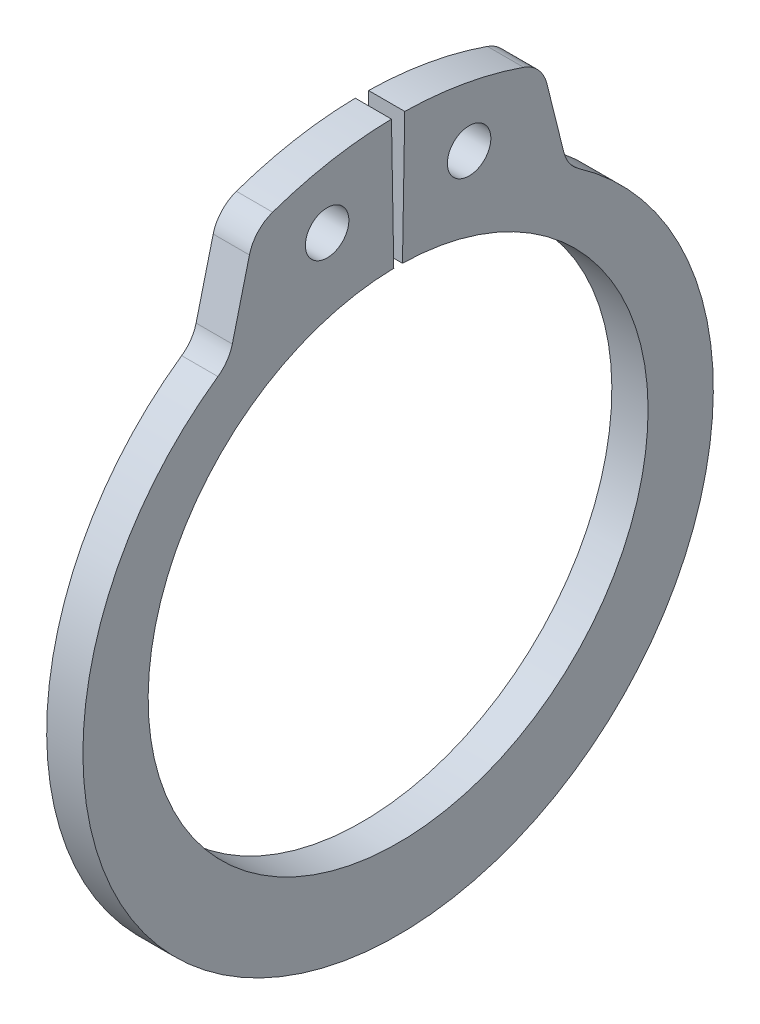
ISO-10303-21;
HEADER;
FILE_DESCRIPTION(('STEP AP214'),'2;1');
FILE_NAME('part.step','',(''),(''),'','','');
FILE_SCHEMA(('AUTOMOTIVE_DESIGN { 1 0 10303 214 1 1 1 1 }'));
ENDSEC;
DATA;
#1=APPLICATION_CONTEXT('core data for automotive mechanical design processes');
#2=APPLICATION_PROTOCOL_DEFINITION('international standard','automotive_design',2000,#1);
#3=PRODUCT_CONTEXT('',#1,'mechanical');
#4=PRODUCT('Part','Part','',(#3));
#5=PRODUCT_RELATED_PRODUCT_CATEGORY('part','',(#4));
#6=PRODUCT_DEFINITION_FORMATION('','',#4);
#7=PRODUCT_DEFINITION_CONTEXT('part definition',#1,'design');
#8=PRODUCT_DEFINITION('design','',#6,#7);
#9=PRODUCT_DEFINITION_SHAPE('','',#8);
#10=(LENGTH_UNIT() NAMED_UNIT(*) SI_UNIT(.MILLI.,.METRE.));
#11=(NAMED_UNIT(*) PLANE_ANGLE_UNIT() SI_UNIT($,.RADIAN.));
#12=(NAMED_UNIT(*) SI_UNIT($,.STERADIAN.) SOLID_ANGLE_UNIT());
#13=UNCERTAINTY_MEASURE_WITH_UNIT(LENGTH_MEASURE(1.E-05),#10,'distance_accuracy_value','');
#14=(GEOMETRIC_REPRESENTATION_CONTEXT(3) GLOBAL_UNCERTAINTY_ASSIGNED_CONTEXT((#13)) GLOBAL_UNIT_ASSIGNED_CONTEXT((#10,
#11,#12)) REPRESENTATION_CONTEXT('',''));
#15=CARTESIAN_POINT('',(0.,0.,0.));
#16=DIRECTION('',(0.,0.,1.));
#17=DIRECTION('',(1.,0.,0.));
#18=AXIS2_PLACEMENT_3D('',#15,#16,#17);
#19=CARTESIAN_POINT('',(0.5,0.,0.));
#20=DIRECTION('',(1.,0.,0.));
#21=DIRECTION('',(0.,0.,-1.));
#22=AXIS2_PLACEMENT_3D('',#19,#20,#21);
#23=PLANE('',#22);
#24=CARTESIAN_POINT('',(0.5,8.66711980549086,-1.9596288316201));
#25=DIRECTION('',(-1.,0.,0.));
#26=DIRECTION('',(0.,0.,1.));
#27=AXIS2_PLACEMENT_3D('',#24,#25,#26);
#28=CIRCLE('',#27,0.6);
#29=CARTESIAN_POINT('',(0.5,8.66711980549086,-1.3596288316201));
#30=VERTEX_POINT('',#29);
#31=EDGE_CURVE('E115',#30,#30,#28,.T.);
#32=ORIENTED_EDGE('',*,*,#31,.T.);
#33=EDGE_LOOP('',(#32));
#34=FACE_BOUND('',#33,.T.);
#35=CARTESIAN_POINT('',(0.5,0.,0.));
#36=DIRECTION('',(-1.,0.,0.));
#37=DIRECTION('',(0.,0.,1.));
#38=AXIS2_PLACEMENT_3D('',#35,#36,#37);
#39=CIRCLE('',#38,6.9);
#40=CARTESIAN_POINT('',(0.5,6.8989490965791,-0.120421604417256));
#41=VERTEX_POINT('',#40);
#42=CARTESIAN_POINT('',(0.5,6.8989490965791,0.120421604417256));
#43=VERTEX_POINT('',#42);
#44=EDGE_CURVE('E173',#41,#43,#39,.T.);
#45=ORIENTED_EDGE('',*,*,#44,.T.);
#46=DIRECTION('',(0.,-0.999847695156391,-0.0174524064372835));
#47=VECTOR('',#46,1.);
#48=CARTESIAN_POINT('',(0.5,6.8989490965791,0.120421604417256));
#49=LINE('',#48,#47);
#50=CARTESIAN_POINT('',(0.5,10.4984007991421,0.183250267591477));
#51=VERTEX_POINT('',#50);
#52=EDGE_CURVE('E126',#43,#51,#49,.F.);
#53=ORIENTED_EDGE('',*,*,#52,.T.);
#54=CARTESIAN_POINT('',(0.5,0.,0.));
#55=DIRECTION('',(-1.,0.,0.));
#56=DIRECTION('',(0.,0.,1.));
#57=AXIS2_PLACEMENT_3D('',#54,#55,#56);
#58=CIRCLE('',#57,10.5);
#59=CARTESIAN_POINT('',(0.5,9.91217887924345,3.46391539531209));
#60=VERTEX_POINT('',#59);
#61=EDGE_CURVE('E129',#60,#51,#58,.T.);
#62=ORIENTED_EDGE('',*,*,#61,.F.);
#63=CARTESIAN_POINT('',(0.5,8.96816184312502,3.13401869099666));
#64=DIRECTION('',(-1.,0.,0.));
#65=DIRECTION('',(0.,0.,1.));
#66=AXIS2_PLACEMENT_3D('',#63,#64,#65);
#67=CIRCLE('',#66,1.);
#68=CARTESIAN_POINT('',(0.5,9.21008373872469,4.10431441727265));
#69=VERTEX_POINT('',#68);
#70=EDGE_CURVE('E119',#69,#60,#67,.T.);
#71=ORIENTED_EDGE('',*,*,#70,.F.);
#72=DIRECTION('',(0.,0.970295726275997,-0.241921895599665));
#73=VECTOR('',#72,1.);
#74=CARTESIAN_POINT('',(0.5,9.71734472745919,3.97784004803122));
#75=LINE('',#74,#73);
#76=CARTESIAN_POINT('',(0.5,7.31761530924591,4.57615979123836));
#77=VERTEX_POINT('',#76);
#78=EDGE_CURVE('E114',#69,#77,#75,.F.);
#79=ORIENTED_EDGE('',*,*,#78,.T.);
#80=CARTESIAN_POINT('',(0.5,7.55953720484558,5.54645551751436));
#81=DIRECTION('',(-1.,0.,0.));
#82=DIRECTION('',(0.,0.,1.));
#83=AXIS2_PLACEMENT_3D('',#80,#81,#82);
#84=CIRCLE('',#83,1.);
#85=CARTESIAN_POINT('',(0.5,6.73911195964233,4.97470170945253));
#86=VERTEX_POINT('',#85);
#87=EDGE_CURVE('E105',#77,#86,#84,.T.);
#88=ORIENTED_EDGE('',*,*,#87,.T.);
#89=CARTESIAN_POINT('',(0.5,-0.399224177769538,0.));
#90=DIRECTION('',(-1.,0.,0.));
#91=DIRECTION('',(0.,0.,1.));
#92=AXIS2_PLACEMENT_3D('',#89,#90,#91);
#93=CIRCLE('',#92,8.70077582223046);
#94=CARTESIAN_POINT('',(0.5,6.73911195964233,-4.97470170945253));
#95=VERTEX_POINT('',#94);
#96=EDGE_CURVE('E183',#95,#86,#93,.T.);
#97=ORIENTED_EDGE('',*,*,#96,.F.);
#98=CARTESIAN_POINT('',(0.5,7.55953720484558,-5.54645551751436));
#99=DIRECTION('',(-1.,0.,0.));
#100=DIRECTION('',(0.,0.,1.));
#101=AXIS2_PLACEMENT_3D('',#98,#99,#100);
#102=CIRCLE('',#101,1.);
#103=CARTESIAN_POINT('',(0.5,7.31761530924591,-4.57615979123836));
#104=VERTEX_POINT('',#103);
#105=EDGE_CURVE('E180',#95,#104,#102,.T.);
#106=ORIENTED_EDGE('',*,*,#105,.T.);
#107=DIRECTION('',(0.,-0.970295726275997,-0.241921895599666));
#108=VECTOR('',#107,1.);
#109=CARTESIAN_POINT('',(0.5,9.71734472745919,-3.97784004803122));
#110=LINE('',#109,#108);
#111=CARTESIAN_POINT('',(0.5,9.21008373872469,-4.10431441727265));
#112=VERTEX_POINT('',#111);
#113=EDGE_CURVE('E136',#104,#112,#110,.F.);
#114=ORIENTED_EDGE('',*,*,#113,.T.);
#115=CARTESIAN_POINT('',(0.5,8.96816184312502,-3.13401869099666));
#116=DIRECTION('',(-1.,0.,0.));
#117=DIRECTION('',(0.,0.,1.));
#118=AXIS2_PLACEMENT_3D('',#115,#116,#117);
#119=CIRCLE('',#118,1.);
#120=CARTESIAN_POINT('',(0.5,9.91217887924345,-3.46391539531209));
#121=VERTEX_POINT('',#120);
#122=EDGE_CURVE('E138',#121,#112,#119,.T.);
#123=ORIENTED_EDGE('',*,*,#122,.F.);
#124=CARTESIAN_POINT('',(0.5,0.,0.));
#125=DIRECTION('',(-1.,0.,0.));
#126=DIRECTION('',(0.,0.,1.));
#127=AXIS2_PLACEMENT_3D('',#124,#125,#126);
#128=CIRCLE('',#127,10.5);
#129=CARTESIAN_POINT('',(0.5,10.4984007991421,-0.183250267591479));
#130=VERTEX_POINT('',#129);
#131=EDGE_CURVE('E175',#130,#121,#128,.T.);
#132=ORIENTED_EDGE('',*,*,#131,.F.);
#133=DIRECTION('',(0.,0.999847695156391,-0.0174524064372841));
#134=VECTOR('',#133,1.);
#135=CARTESIAN_POINT('',(0.5,10.4984007991421,-0.183250267591479));
#136=LINE('',#135,#134);
#137=EDGE_CURVE('E131',#130,#41,#136,.F.);
#138=ORIENTED_EDGE('',*,*,#137,.T.);
#139=EDGE_LOOP('',(#45,#53,#62,#71,#79,#88,#97,#106,#114,#123,#132,#138));
#140=FACE_BOUND('',#139,.T.);
#141=CARTESIAN_POINT('',(0.5,8.66711980549086,1.9596288316201));
#142=DIRECTION('',(-1.,0.,0.));
#143=DIRECTION('',(0.,0.,1.));
#144=AXIS2_PLACEMENT_3D('',#141,#142,#143);
#145=CIRCLE('',#144,0.6);
#146=CARTESIAN_POINT('',(0.5,8.66711980549086,2.5596288316201));
#147=VERTEX_POINT('',#146);
#148=EDGE_CURVE('E20',#147,#147,#145,.T.);
#149=ORIENTED_EDGE('',*,*,#148,.T.);
#150=EDGE_LOOP('',(#149));
#151=FACE_BOUND('',#150,.T.);
#152=ADVANCED_FACE('F17',(#34,#140,#151),#23,.T.);
#153=CARTESIAN_POINT('',(0.5,8.66711980549086,1.9596288316201));
#154=DIRECTION('',(-1.,0.,0.));
#155=DIRECTION('',(0.,0.,1.));
#156=AXIS2_PLACEMENT_3D('',#153,#154,#155);
#157=CYLINDRICAL_SURFACE('',#156,0.6);
#158=CARTESIAN_POINT('',(-0.5,8.66711980549086,1.9596288316201));
#159=DIRECTION('',(-1.,0.,0.));
#160=DIRECTION('',(0.,0.,1.));
#161=AXIS2_PLACEMENT_3D('',#158,#159,#160);
#162=CIRCLE('',#161,0.6);
#163=CARTESIAN_POINT('',(-0.5,8.66711980549086,2.5596288316201));
#164=VERTEX_POINT('',#163);
#165=EDGE_CURVE('E165',#164,#164,#162,.T.);
#166=ORIENTED_EDGE('',*,*,#165,.T.);
#167=EDGE_LOOP('',(#166));
#168=FACE_BOUND('',#167,.T.);
#169=ORIENTED_EDGE('',*,*,#148,.F.);
#170=EDGE_LOOP('',(#169));
#171=FACE_BOUND('',#170,.T.);
#172=ADVANCED_FACE('F368',(#168,#171),#157,.F.);
#173=CARTESIAN_POINT('',(0.5,7.55953720484558,5.54645551751436));
#174=DIRECTION('',(-1.,0.,0.));
#175=DIRECTION('',(0.,0.,1.));
#176=AXIS2_PLACEMENT_3D('',#173,#174,#175);
#177=CYLINDRICAL_SURFACE('',#176,1.);
#178=DIRECTION('',(1.,0.,0.));
#179=VECTOR('',#178,1.);
#180=CARTESIAN_POINT('',(0.5,7.31761530924591,4.57615979123836));
#181=LINE('',#180,#179);
#182=CARTESIAN_POINT('',(-0.5,7.31761530924591,4.57615979123836));
#183=VERTEX_POINT('',#182);
#184=EDGE_CURVE('E109',#77,#183,#181,.F.);
#185=ORIENTED_EDGE('',*,*,#184,.T.);
#186=CARTESIAN_POINT('',(-0.5,7.55953720484558,5.54645551751436));
#187=DIRECTION('',(-1.,0.,0.));
#188=DIRECTION('',(0.,0.,1.));
#189=AXIS2_PLACEMENT_3D('',#186,#187,#188);
#190=CIRCLE('',#189,1.);
#191=CARTESIAN_POINT('',(-0.5,6.73911195964233,4.97470170945253));
#192=VERTEX_POINT('',#191);
#193=EDGE_CURVE('E163',#183,#192,#190,.T.);
#194=ORIENTED_EDGE('',*,*,#193,.T.);
#195=DIRECTION('',(-1.,0.,0.));
#196=VECTOR('',#195,1.);
#197=CARTESIAN_POINT('',(0.5,6.73911195964233,4.97470170945253));
#198=LINE('',#197,#196);
#199=EDGE_CURVE('E110',#86,#192,#198,.T.);
#200=ORIENTED_EDGE('',*,*,#199,.F.);
#201=ORIENTED_EDGE('',*,*,#87,.F.);
#202=EDGE_LOOP('',(#185,#194,#200,#201));
#203=FACE_BOUND('',#202,.T.);
#204=ADVANCED_FACE('F107',(#203),#177,.F.);
#205=CARTESIAN_POINT('',(0.5,-0.399224177769538,0.));
#206=DIRECTION('',(-1.,0.,0.));
#207=DIRECTION('',(0.,0.,1.));
#208=AXIS2_PLACEMENT_3D('',#205,#206,#207);
#209=CYLINDRICAL_SURFACE('',#208,8.70077582223046);
#210=CARTESIAN_POINT('',(-0.5,-0.399224177769538,0.));
#211=DIRECTION('',(-1.,0.,0.));
#212=DIRECTION('',(0.,0.,1.));
#213=AXIS2_PLACEMENT_3D('',#210,#211,#212);
#214=CIRCLE('',#213,8.70077582223046);
#215=CARTESIAN_POINT('',(-0.5,6.73911195964233,-4.97470170945253));
#216=VERTEX_POINT('',#215);
#217=EDGE_CURVE('E161',#192,#216,#214,.F.);
#218=ORIENTED_EDGE('',*,*,#217,.T.);
#219=DIRECTION('',(-1.,0.,0.));
#220=VECTOR('',#219,1.);
#221=CARTESIAN_POINT('',(0.5,6.73911195964233,-4.97470170945253));
#222=LINE('',#221,#220);
#223=EDGE_CURVE('E182',#216,#95,#222,.F.);
#224=ORIENTED_EDGE('',*,*,#223,.T.);
#225=ORIENTED_EDGE('',*,*,#96,.T.);
#226=ORIENTED_EDGE('',*,*,#199,.T.);
#227=EDGE_LOOP('',(#218,#224,#225,#226));
#228=FACE_BOUND('',#227,.T.);
#229=ADVANCED_FACE('F188',(#228),#209,.T.);
#230=CARTESIAN_POINT('',(0.5,7.55953720484558,-5.54645551751436));
#231=DIRECTION('',(-1.,0.,0.));
#232=DIRECTION('',(0.,0.,1.));
#233=AXIS2_PLACEMENT_3D('',#230,#231,#232);
#234=CYLINDRICAL_SURFACE('',#233,1.);
#235=ORIENTED_EDGE('',*,*,#223,.F.);
#236=CARTESIAN_POINT('',(-0.5,7.55953720484558,-5.54645551751436));
#237=DIRECTION('',(-1.,0.,0.));
#238=DIRECTION('',(0.,0.,1.));
#239=AXIS2_PLACEMENT_3D('',#236,#237,#238);
#240=CIRCLE('',#239,1.);
#241=CARTESIAN_POINT('',(-0.5,7.31761530924591,-4.57615979123836));
#242=VERTEX_POINT('',#241);
#243=EDGE_CURVE('E158',#216,#242,#240,.T.);
#244=ORIENTED_EDGE('',*,*,#243,.T.);
#245=DIRECTION('',(1.,0.,0.));
#246=VECTOR('',#245,1.);
#247=CARTESIAN_POINT('',(0.5,7.31761530924591,-4.57615979123836));
#248=LINE('',#247,#246);
#249=EDGE_CURVE('E139',#242,#104,#248,.T.);
#250=ORIENTED_EDGE('',*,*,#249,.T.);
#251=ORIENTED_EDGE('',*,*,#105,.F.);
#252=EDGE_LOOP('',(#235,#244,#250,#251));
#253=FACE_BOUND('',#252,.T.);
#254=ADVANCED_FACE('F200',(#253),#234,.F.);
#255=CARTESIAN_POINT('',(0.5,9.71734472745919,-3.97784004803122));
#256=DIRECTION('',(0.,-0.241921895599666,0.970295726275997));
#257=DIRECTION('',(0.,-0.970295726275997,-0.241921895599666));
#258=AXIS2_PLACEMENT_3D('',#255,#256,#257);
#259=PLANE('',#258);
#260=DIRECTION('',(-1.,0.,0.));
#261=VECTOR('',#260,1.);
#262=CARTESIAN_POINT('',(0.5,9.21008373872469,-4.10431441727265));
#263=LINE('',#262,#261);
#264=CARTESIAN_POINT('',(-0.5,9.21008373872469,-4.10431441727265));
#265=VERTEX_POINT('',#264);
#266=EDGE_CURVE('E178',#112,#265,#263,.T.);
#267=ORIENTED_EDGE('',*,*,#266,.F.);
#268=ORIENTED_EDGE('',*,*,#113,.F.);
#269=ORIENTED_EDGE('',*,*,#249,.F.);
#270=DIRECTION('',(0.,0.970295726275997,0.241921895599666));
#271=VECTOR('',#270,1.);
#272=CARTESIAN_POINT('',(-0.5,7.31761530924591,-4.57615979123836));
#273=LINE('',#272,#271);
#274=EDGE_CURVE('E157',#242,#265,#273,.T.);
#275=ORIENTED_EDGE('',*,*,#274,.T.);
#276=EDGE_LOOP('',(#267,#268,#269,#275));
#277=FACE_BOUND('',#276,.T.);
#278=ADVANCED_FACE('F206',(#277),#259,.F.);
#279=CARTESIAN_POINT('',(0.5,8.96816184312502,-3.13401869099666));
#280=DIRECTION('',(-1.,0.,0.));
#281=DIRECTION('',(0.,0.,1.));
#282=AXIS2_PLACEMENT_3D('',#279,#280,#281);
#283=CYLINDRICAL_SURFACE('',#282,1.);
#284=CARTESIAN_POINT('',(-0.5,8.96816184312502,-3.13401869099666));
#285=DIRECTION('',(-1.,0.,0.));
#286=DIRECTION('',(0.,0.,1.));
#287=AXIS2_PLACEMENT_3D('',#284,#285,#286);
#288=CIRCLE('',#287,1.);
#289=CARTESIAN_POINT('',(-0.5,9.91217887924345,-3.46391539531209));
#290=VERTEX_POINT('',#289);
#291=EDGE_CURVE('E154',#265,#290,#288,.F.);
#292=ORIENTED_EDGE('',*,*,#291,.T.);
#293=DIRECTION('',(-1.,0.,0.));
#294=VECTOR('',#293,1.);
#295=CARTESIAN_POINT('',(0.5,9.91217887924345,-3.46391539531209));
#296=LINE('',#295,#294);
#297=EDGE_CURVE('E177',#121,#290,#296,.T.);
#298=ORIENTED_EDGE('',*,*,#297,.F.);
#299=ORIENTED_EDGE('',*,*,#122,.T.);
#300=ORIENTED_EDGE('',*,*,#266,.T.);
#301=EDGE_LOOP('',(#292,#298,#299,#300));
#302=FACE_BOUND('',#301,.T.);
#303=ADVANCED_FACE('F246',(#302),#283,.T.);
#304=CARTESIAN_POINT('',(0.5,0.,0.));
#305=DIRECTION('',(-1.,0.,0.));
#306=DIRECTION('',(0.,0.,1.));
#307=AXIS2_PLACEMENT_3D('',#304,#305,#306);
#308=CYLINDRICAL_SURFACE('',#307,10.5);
#309=CARTESIAN_POINT('',(-0.5,0.,0.));
#310=DIRECTION('',(-1.,0.,0.));
#311=DIRECTION('',(0.,0.,1.));
#312=AXIS2_PLACEMENT_3D('',#309,#310,#311);
#313=CIRCLE('',#312,10.5);
#314=CARTESIAN_POINT('',(-0.5,10.4984007991421,-0.183250267591479));
#315=VERTEX_POINT('',#314);
#316=EDGE_CURVE('E151',#290,#315,#313,.F.);
#317=ORIENTED_EDGE('',*,*,#316,.T.);
#318=DIRECTION('',(1.,0.,0.));
#319=VECTOR('',#318,1.);
#320=CARTESIAN_POINT('',(0.5,10.4984007991421,-0.183250267591479));
#321=LINE('',#320,#319);
#322=EDGE_CURVE('E135',#315,#130,#321,.T.);
#323=ORIENTED_EDGE('',*,*,#322,.T.);
#324=ORIENTED_EDGE('',*,*,#131,.T.);
#325=ORIENTED_EDGE('',*,*,#297,.T.);
#326=EDGE_LOOP('',(#317,#323,#324,#325));
#327=FACE_BOUND('',#326,.T.);
#328=ADVANCED_FACE('F244',(#327),#308,.T.);
#329=CARTESIAN_POINT('',(0.5,10.4984007991421,-0.183250267591479));
#330=DIRECTION('',(0.,-0.0174524064372841,-0.999847695156391));
#331=DIRECTION('',(0.,0.999847695156391,-0.0174524064372841));
#332=AXIS2_PLACEMENT_3D('',#329,#330,#331);
#333=PLANE('',#332);
#334=DIRECTION('',(-1.,0.,0.));
#335=VECTOR('',#334,1.);
#336=CARTESIAN_POINT('',(0.5,6.8989490965791,-0.120421604417256));
#337=LINE('',#336,#335);
#338=CARTESIAN_POINT('',(-0.5,6.8989490965791,-0.120421604417256));
#339=VERTEX_POINT('',#338);
#340=EDGE_CURVE('E134',#339,#41,#337,.F.);
#341=ORIENTED_EDGE('',*,*,#340,.T.);
#342=ORIENTED_EDGE('',*,*,#137,.F.);
#343=ORIENTED_EDGE('',*,*,#322,.F.);
#344=DIRECTION('',(0.,-0.999847695156391,0.017452406437284));
#345=VECTOR('',#344,1.);
#346=CARTESIAN_POINT('',(-0.5,10.4984007991421,-0.183250267591479));
#347=LINE('',#346,#345);
#348=EDGE_CURVE('E150',#315,#339,#347,.T.);
#349=ORIENTED_EDGE('',*,*,#348,.T.);
#350=EDGE_LOOP('',(#341,#342,#343,#349));
#351=FACE_BOUND('',#350,.T.);
#352=ADVANCED_FACE('F241',(#351),#333,.F.);
#353=CARTESIAN_POINT('',(0.5,0.,0.));
#354=DIRECTION('',(-1.,0.,0.));
#355=DIRECTION('',(0.,0.,1.));
#356=AXIS2_PLACEMENT_3D('',#353,#354,#355);
#357=CYLINDRICAL_SURFACE('',#356,6.9);
#358=ORIENTED_EDGE('',*,*,#44,.F.);
#359=ORIENTED_EDGE('',*,*,#340,.F.);
#360=CARTESIAN_POINT('',(-0.5,0.,0.));
#361=DIRECTION('',(-1.,0.,0.));
#362=DIRECTION('',(0.,0.,1.));
#363=AXIS2_PLACEMENT_3D('',#360,#361,#362);
#364=CIRCLE('',#363,6.9);
#365=CARTESIAN_POINT('',(-0.5,6.8989490965791,0.120421604417256));
#366=VERTEX_POINT('',#365);
#367=EDGE_CURVE('E148',#339,#366,#364,.T.);
#368=ORIENTED_EDGE('',*,*,#367,.T.);
#369=DIRECTION('',(1.,0.,0.));
#370=VECTOR('',#369,1.);
#371=CARTESIAN_POINT('',(0.5,6.8989490965791,0.120421604417256));
#372=LINE('',#371,#370);
#373=EDGE_CURVE('E130',#366,#43,#372,.T.);
#374=ORIENTED_EDGE('',*,*,#373,.T.);
#375=EDGE_LOOP('',(#358,#359,#368,#374));
#376=FACE_BOUND('',#375,.T.);
#377=ADVANCED_FACE('F238',(#376),#357,.F.);
#378=CARTESIAN_POINT('',(0.5,6.8989490965791,0.120421604417256));
#379=DIRECTION('',(0.,-0.0174524064372835,0.999847695156391));
#380=DIRECTION('',(0.,-0.999847695156391,-0.0174524064372835));
#381=AXIS2_PLACEMENT_3D('',#378,#379,#380);
#382=PLANE('',#381);
#383=DIRECTION('',(-1.,0.,0.));
#384=VECTOR('',#383,1.);
#385=CARTESIAN_POINT('',(0.5,10.4984007991421,0.183250267591476));
#386=LINE('',#385,#384);
#387=CARTESIAN_POINT('',(-0.5,10.4984007991421,0.183250267591477));
#388=VERTEX_POINT('',#387);
#389=EDGE_CURVE('E171',#51,#388,#386,.T.);
#390=ORIENTED_EDGE('',*,*,#389,.F.);
#391=ORIENTED_EDGE('',*,*,#52,.F.);
#392=ORIENTED_EDGE('',*,*,#373,.F.);
#393=DIRECTION('',(0.,0.999847695156391,0.0174524064372835));
#394=VECTOR('',#393,1.);
#395=CARTESIAN_POINT('',(-0.5,6.8989490965791,0.120421604417256));
#396=LINE('',#395,#394);
#397=EDGE_CURVE('E147',#366,#388,#396,.T.);
#398=ORIENTED_EDGE('',*,*,#397,.T.);
#399=EDGE_LOOP('',(#390,#391,#392,#398));
#400=FACE_BOUND('',#399,.T.);
#401=ADVANCED_FACE('F229',(#400),#382,.F.);
#402=CARTESIAN_POINT('',(0.5,0.,0.));
#403=DIRECTION('',(-1.,0.,0.));
#404=DIRECTION('',(0.,0.,1.));
#405=AXIS2_PLACEMENT_3D('',#402,#403,#404);
#406=CYLINDRICAL_SURFACE('',#405,10.5);
#407=ORIENTED_EDGE('',*,*,#61,.T.);
#408=ORIENTED_EDGE('',*,*,#389,.T.);
#409=CARTESIAN_POINT('',(-0.5,0.,0.));
#410=DIRECTION('',(-1.,0.,0.));
#411=DIRECTION('',(0.,0.,1.));
#412=AXIS2_PLACEMENT_3D('',#409,#410,#411);
#413=CIRCLE('',#412,10.5);
#414=CARTESIAN_POINT('',(-0.5,9.91217887924345,3.46391539531209));
#415=VERTEX_POINT('',#414);
#416=EDGE_CURVE('E144',#388,#415,#413,.F.);
#417=ORIENTED_EDGE('',*,*,#416,.T.);
#418=DIRECTION('',(-1.,0.,0.));
#419=VECTOR('',#418,1.);
#420=CARTESIAN_POINT('',(0.5,9.91217887924345,3.46391539531209));
#421=LINE('',#420,#419);
#422=EDGE_CURVE('E121',#60,#415,#421,.T.);
#423=ORIENTED_EDGE('',*,*,#422,.F.);
#424=EDGE_LOOP('',(#407,#408,#417,#423));
#425=FACE_BOUND('',#424,.T.);
#426=ADVANCED_FACE('F236',(#425),#406,.T.);
#427=CARTESIAN_POINT('',(0.5,8.96816184312502,3.13401869099666));
#428=DIRECTION('',(-1.,0.,0.));
#429=DIRECTION('',(0.,0.,1.));
#430=AXIS2_PLACEMENT_3D('',#427,#428,#429);
#431=CYLINDRICAL_SURFACE('',#430,1.);
#432=CARTESIAN_POINT('',(-0.5,8.96816184312502,3.13401869099666));
#433=DIRECTION('',(-1.,0.,0.));
#434=DIRECTION('',(0.,0.,1.));
#435=AXIS2_PLACEMENT_3D('',#432,#433,#434);
#436=CIRCLE('',#435,1.);
#437=CARTESIAN_POINT('',(-0.5,9.21008373872469,4.10431441727265));
#438=VERTEX_POINT('',#437);
#439=EDGE_CURVE('E141',#415,#438,#436,.F.);
#440=ORIENTED_EDGE('',*,*,#439,.T.);
#441=DIRECTION('',(1.,0.,0.));
#442=VECTOR('',#441,1.);
#443=CARTESIAN_POINT('',(0.5,9.21008373872469,4.10431441727265));
#444=LINE('',#443,#442);
#445=EDGE_CURVE('E35',#438,#69,#444,.T.);
#446=ORIENTED_EDGE('',*,*,#445,.T.);
#447=ORIENTED_EDGE('',*,*,#70,.T.);
#448=ORIENTED_EDGE('',*,*,#422,.T.);
#449=EDGE_LOOP('',(#440,#446,#447,#448));
#450=FACE_BOUND('',#449,.T.);
#451=ADVANCED_FACE('F269',(#450),#431,.T.);
#452=CARTESIAN_POINT('',(0.5,9.71734472745919,3.97784004803122));
#453=DIRECTION('',(0.,-0.241921895599665,-0.970295726275997));
#454=DIRECTION('',(0.,0.970295726275997,-0.241921895599665));
#455=AXIS2_PLACEMENT_3D('',#452,#453,#454);
#456=PLANE('',#455);
#457=ORIENTED_EDGE('',*,*,#184,.F.);
#458=ORIENTED_EDGE('',*,*,#78,.F.);
#459=ORIENTED_EDGE('',*,*,#445,.F.);
#460=DIRECTION('',(0.,-0.970295726275997,0.241921895599665));
#461=VECTOR('',#460,1.);
#462=CARTESIAN_POINT('',(-0.5,9.21008373872469,4.10431441727265));
#463=LINE('',#462,#461);
#464=EDGE_CURVE('E26',#438,#183,#463,.T.);
#465=ORIENTED_EDGE('',*,*,#464,.T.);
#466=EDGE_LOOP('',(#457,#458,#459,#465));
#467=FACE_BOUND('',#466,.T.);
#468=ADVANCED_FACE('F113',(#467),#456,.F.);
#469=CARTESIAN_POINT('',(0.5,8.66711980549086,-1.9596288316201));
#470=DIRECTION('',(-1.,0.,0.));
#471=DIRECTION('',(0.,0.,1.));
#472=AXIS2_PLACEMENT_3D('',#469,#470,#471);
#473=CYLINDRICAL_SURFACE('',#472,0.6);
#474=CARTESIAN_POINT('',(-0.5,8.66711980549086,-1.9596288316201));
#475=DIRECTION('',(-1.,0.,0.));
#476=DIRECTION('',(0.,0.,1.));
#477=AXIS2_PLACEMENT_3D('',#474,#475,#476);
#478=CIRCLE('',#477,0.6);
#479=CARTESIAN_POINT('',(-0.5,8.66711980549086,-1.3596288316201));
#480=VERTEX_POINT('',#479);
#481=EDGE_CURVE('E11',#480,#480,#478,.T.);
#482=ORIENTED_EDGE('',*,*,#481,.T.);
#483=EDGE_LOOP('',(#482));
#484=FACE_BOUND('',#483,.T.);
#485=ORIENTED_EDGE('',*,*,#31,.F.);
#486=EDGE_LOOP('',(#485));
#487=FACE_BOUND('',#486,.T.);
#488=ADVANCED_FACE('F257',(#484,#487),#473,.F.);
#489=CARTESIAN_POINT('',(-0.5,0.,0.));
#490=DIRECTION('',(1.,0.,0.));
#491=DIRECTION('',(0.,0.,-1.));
#492=AXIS2_PLACEMENT_3D('',#489,#490,#491);
#493=PLANE('',#492);
#494=ORIENTED_EDGE('',*,*,#481,.F.);
#495=EDGE_LOOP('',(#494));
#496=FACE_BOUND('',#495,.T.);
#497=ORIENTED_EDGE('',*,*,#439,.F.);
#498=ORIENTED_EDGE('',*,*,#416,.F.);
#499=ORIENTED_EDGE('',*,*,#397,.F.);
#500=ORIENTED_EDGE('',*,*,#367,.F.);
#501=ORIENTED_EDGE('',*,*,#348,.F.);
#502=ORIENTED_EDGE('',*,*,#316,.F.);
#503=ORIENTED_EDGE('',*,*,#291,.F.);
#504=ORIENTED_EDGE('',*,*,#274,.F.);
#505=ORIENTED_EDGE('',*,*,#243,.F.);
#506=ORIENTED_EDGE('',*,*,#217,.F.);
#507=ORIENTED_EDGE('',*,*,#193,.F.);
#508=ORIENTED_EDGE('',*,*,#464,.F.);
#509=EDGE_LOOP('',(#497,#498,#499,#500,#501,#502,#503,#504,#505,#506,#507,#508));
#510=FACE_BOUND('',#509,.T.);
#511=ORIENTED_EDGE('',*,*,#165,.F.);
#512=EDGE_LOOP('',(#511));
#513=FACE_BOUND('',#512,.T.);
#514=ADVANCED_FACE('F193',(#496,#510,#513),#493,.F.);
#515=CLOSED_SHELL('',(#152,#172,#204,#229,#254,#278,#303,#328,#352,#377,#401,#426,#451,#468,
#488,#514));
#516=MANIFOLD_SOLID_BREP('B1',#515);
#517=ADVANCED_BREP_SHAPE_REPRESENTATION('',(#18,#516),#14);
#518=SHAPE_DEFINITION_REPRESENTATION(#9,#517);
ENDSEC;
END-ISO-10303-21;
